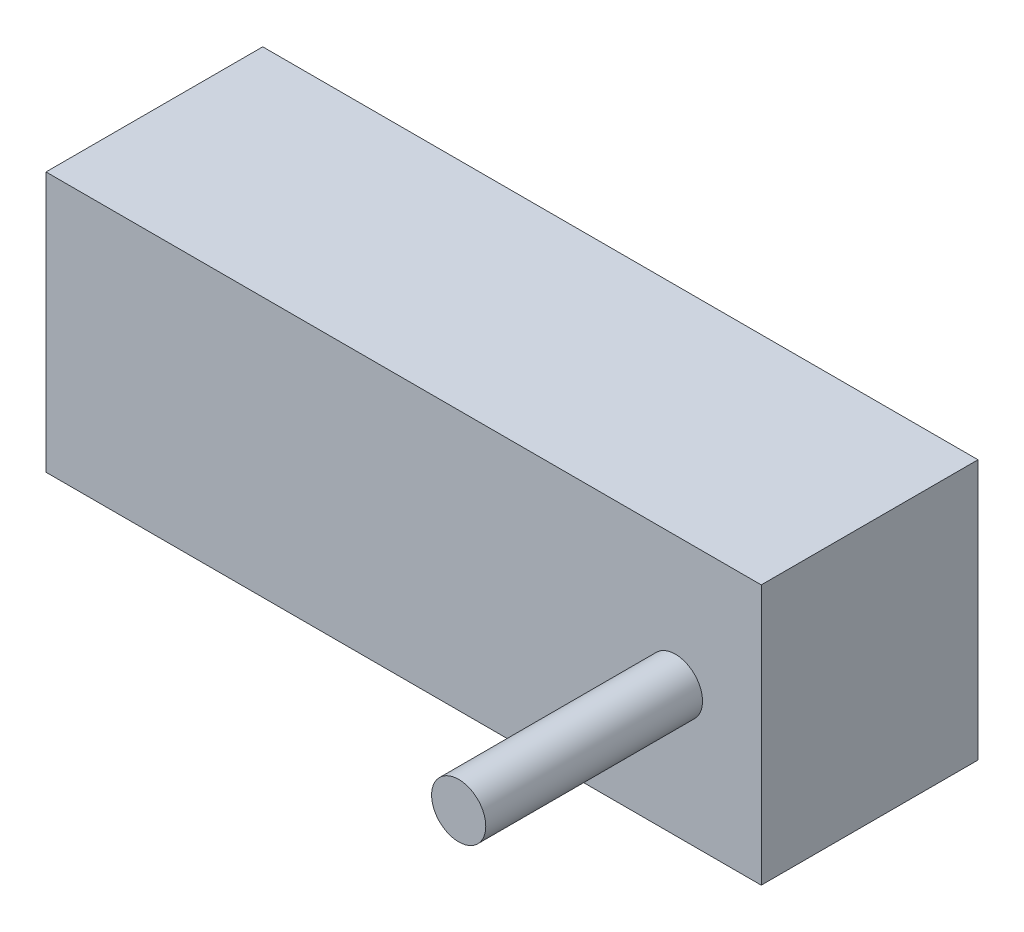
ISO-10303-21;
HEADER;
FILE_DESCRIPTION(('STEP AP214'),'2;1');
FILE_NAME('part.step','',(''),(''),'','','');
FILE_SCHEMA(('AUTOMOTIVE_DESIGN { 1 0 10303 214 1 1 1 1 }'));
ENDSEC;
DATA;
#1=APPLICATION_CONTEXT('core data for automotive mechanical design processes');
#2=APPLICATION_PROTOCOL_DEFINITION('international standard','automotive_design',2000,#1);
#3=PRODUCT_CONTEXT('',#1,'mechanical');
#4=PRODUCT('Part','Part','',(#3));
#5=PRODUCT_RELATED_PRODUCT_CATEGORY('part','',(#4));
#6=PRODUCT_DEFINITION_FORMATION('','',#4);
#7=PRODUCT_DEFINITION_CONTEXT('part definition',#1,'design');
#8=PRODUCT_DEFINITION('design','',#6,#7);
#9=PRODUCT_DEFINITION_SHAPE('','',#8);
#10=(LENGTH_UNIT() NAMED_UNIT(*) SI_UNIT(.MILLI.,.METRE.));
#11=(NAMED_UNIT(*) PLANE_ANGLE_UNIT() SI_UNIT($,.RADIAN.));
#12=(NAMED_UNIT(*) SI_UNIT($,.STERADIAN.) SOLID_ANGLE_UNIT());
#13=UNCERTAINTY_MEASURE_WITH_UNIT(LENGTH_MEASURE(1.E-05),#10,'distance_accuracy_value','');
#14=(GEOMETRIC_REPRESENTATION_CONTEXT(3) GLOBAL_UNCERTAINTY_ASSIGNED_CONTEXT((#13)) GLOBAL_UNIT_ASSIGNED_CONTEXT((#10,
#11,#12)) REPRESENTATION_CONTEXT('',''));
#15=CARTESIAN_POINT('',(0.,0.,0.));
#16=DIRECTION('',(0.,0.,1.));
#17=DIRECTION('',(1.,0.,0.));
#18=AXIS2_PLACEMENT_3D('',#15,#16,#17);
#19=CARTESIAN_POINT('',(29.04,6.,20.));
#20=DIRECTION('',(0.,0.,-1.));
#21=DIRECTION('',(-1.,0.,0.));
#22=AXIS2_PLACEMENT_3D('',#19,#20,#21);
#23=CYLINDRICAL_SURFACE('',#22,1.25);
#24=CARTESIAN_POINT('',(29.04,6.,20.));
#25=DIRECTION('',(0.,0.,1.));
#26=DIRECTION('',(1.,0.,0.));
#27=AXIS2_PLACEMENT_3D('',#24,#25,#26);
#28=CIRCLE('',#27,1.25);
#29=CARTESIAN_POINT('',(30.29,6.,20.));
#30=VERTEX_POINT('',#29);
#31=EDGE_CURVE('E48',#30,#30,#28,.T.);
#32=ORIENTED_EDGE('',*,*,#31,.F.);
#33=EDGE_LOOP('',(#32));
#34=FACE_BOUND('',#33,.T.);
#35=CARTESIAN_POINT('',(29.04,6.,10.));
#36=DIRECTION('',(0.,0.,-1.));
#37=DIRECTION('',(-1.,0.,0.));
#38=AXIS2_PLACEMENT_3D('',#35,#36,#37);
#39=CIRCLE('',#38,1.25);
#40=CARTESIAN_POINT('',(27.79,6.,10.));
#41=VERTEX_POINT('',#40);
#42=EDGE_CURVE('E11',#41,#41,#39,.T.);
#43=ORIENTED_EDGE('',*,*,#42,.F.);
#44=EDGE_LOOP('',(#43));
#45=FACE_BOUND('',#44,.T.);
#46=ADVANCED_FACE('F39',(#34,#45),#23,.T.);
#47=CARTESIAN_POINT('',(29.04,6.,20.));
#48=DIRECTION('',(0.,0.,1.));
#49=DIRECTION('',(1.,0.,0.));
#50=AXIS2_PLACEMENT_3D('',#47,#48,#49);
#51=PLANE('',#50);
#52=ORIENTED_EDGE('',*,*,#31,.T.);
#53=EDGE_LOOP('',(#52));
#54=FACE_BOUND('',#53,.T.);
#55=ADVANCED_FACE('F131',(#54),#51,.T.);
#56=CARTESIAN_POINT('',(0.,0.,10.));
#57=DIRECTION('',(0.,0.,-1.));
#58=DIRECTION('',(-1.,0.,0.));
#59=AXIS2_PLACEMENT_3D('',#56,#57,#58);
#60=PLANE('',#59);
#61=DIRECTION('',(0.,-1.,0.));
#62=VECTOR('',#61,1.);
#63=CARTESIAN_POINT('',(0.,0.,10.));
#64=LINE('',#63,#62);
#65=CARTESIAN_POINT('',(0.,12.,10.));
#66=VERTEX_POINT('',#65);
#67=CARTESIAN_POINT('',(0.,0.,10.));
#68=VERTEX_POINT('',#67);
#69=EDGE_CURVE('E93',#66,#68,#64,.T.);
#70=ORIENTED_EDGE('',*,*,#69,.T.);
#71=DIRECTION('',(1.,0.,0.));
#72=VECTOR('',#71,1.);
#73=CARTESIAN_POINT('',(0.,0.,10.));
#74=LINE('',#73,#72);
#75=CARTESIAN_POINT('',(33.,0.,10.));
#76=VERTEX_POINT('',#75);
#77=EDGE_CURVE('E87',#68,#76,#74,.T.);
#78=ORIENTED_EDGE('',*,*,#77,.T.);
#79=DIRECTION('',(0.,1.,0.));
#80=VECTOR('',#79,1.);
#81=CARTESIAN_POINT('',(33.,0.,10.));
#82=LINE('',#81,#80);
#83=CARTESIAN_POINT('',(33.,12.,10.));
#84=VERTEX_POINT('',#83);
#85=EDGE_CURVE('E91',#76,#84,#82,.T.);
#86=ORIENTED_EDGE('',*,*,#85,.T.);
#87=DIRECTION('',(-1.,0.,0.));
#88=VECTOR('',#87,1.);
#89=CARTESIAN_POINT('',(0.,12.,10.));
#90=LINE('',#89,#88);
#91=EDGE_CURVE('E56',#84,#66,#90,.T.);
#92=ORIENTED_EDGE('',*,*,#91,.T.);
#93=EDGE_LOOP('',(#70,#78,#86,#92));
#94=FACE_BOUND('',#93,.T.);
#95=ORIENTED_EDGE('',*,*,#42,.T.);
#96=EDGE_LOOP('',(#95));
#97=FACE_BOUND('',#96,.T.);
#98=ADVANCED_FACE('F88',(#94,#97),#60,.F.);
#99=CARTESIAN_POINT('',(0.,0.,10.));
#100=DIRECTION('',(1.,0.,0.));
#101=DIRECTION('',(0.,0.,-1.));
#102=AXIS2_PLACEMENT_3D('',#99,#100,#101);
#103=PLANE('',#102);
#104=DIRECTION('',(0.,-1.,0.));
#105=VECTOR('',#104,1.);
#106=CARTESIAN_POINT('',(0.,0.,0.));
#107=LINE('',#106,#105);
#108=CARTESIAN_POINT('',(0.,12.,0.));
#109=VERTEX_POINT('',#108);
#110=CARTESIAN_POINT('',(0.,0.,0.));
#111=VERTEX_POINT('',#110);
#112=EDGE_CURVE('E112',#109,#111,#107,.T.);
#113=ORIENTED_EDGE('',*,*,#112,.T.);
#114=DIRECTION('',(0.,0.,-1.));
#115=VECTOR('',#114,1.);
#116=CARTESIAN_POINT('',(0.,0.,10.));
#117=LINE('',#116,#115);
#118=EDGE_CURVE('E101',#68,#111,#117,.T.);
#119=ORIENTED_EDGE('',*,*,#118,.F.);
#120=ORIENTED_EDGE('',*,*,#69,.F.);
#121=DIRECTION('',(0.,0.,-1.));
#122=VECTOR('',#121,1.);
#123=CARTESIAN_POINT('',(0.,12.,10.));
#124=LINE('',#123,#122);
#125=EDGE_CURVE('E108',#66,#109,#124,.T.);
#126=ORIENTED_EDGE('',*,*,#125,.T.);
#127=EDGE_LOOP('',(#113,#119,#120,#126));
#128=FACE_BOUND('',#127,.T.);
#129=ADVANCED_FACE('F137',(#128),#103,.F.);
#130=CARTESIAN_POINT('',(0.,0.,10.));
#131=DIRECTION('',(0.,1.,0.));
#132=DIRECTION('',(0.,0.,1.));
#133=AXIS2_PLACEMENT_3D('',#130,#131,#132);
#134=PLANE('',#133);
#135=DIRECTION('',(1.,0.,0.));
#136=VECTOR('',#135,1.);
#137=CARTESIAN_POINT('',(0.,0.,0.));
#138=LINE('',#137,#136);
#139=CARTESIAN_POINT('',(33.,0.,0.));
#140=VERTEX_POINT('',#139);
#141=EDGE_CURVE('E99',#111,#140,#138,.T.);
#142=ORIENTED_EDGE('',*,*,#141,.T.);
#143=DIRECTION('',(0.,0.,-1.));
#144=VECTOR('',#143,1.);
#145=CARTESIAN_POINT('',(33.,0.,10.));
#146=LINE('',#145,#144);
#147=EDGE_CURVE('E97',#76,#140,#146,.T.);
#148=ORIENTED_EDGE('',*,*,#147,.F.);
#149=ORIENTED_EDGE('',*,*,#77,.F.);
#150=ORIENTED_EDGE('',*,*,#118,.T.);
#151=EDGE_LOOP('',(#142,#148,#149,#150));
#152=FACE_BOUND('',#151,.T.);
#153=ADVANCED_FACE('F98',(#152),#134,.F.);
#154=CARTESIAN_POINT('',(33.,0.,10.));
#155=DIRECTION('',(-1.,0.,0.));
#156=DIRECTION('',(0.,0.,1.));
#157=AXIS2_PLACEMENT_3D('',#154,#155,#156);
#158=PLANE('',#157);
#159=DIRECTION('',(0.,1.,0.));
#160=VECTOR('',#159,1.);
#161=CARTESIAN_POINT('',(33.,0.,0.));
#162=LINE('',#161,#160);
#163=CARTESIAN_POINT('',(33.,12.,0.));
#164=VERTEX_POINT('',#163);
#165=EDGE_CURVE('E73',#140,#164,#162,.T.);
#166=ORIENTED_EDGE('',*,*,#165,.T.);
#167=DIRECTION('',(0.,0.,-1.));
#168=VECTOR('',#167,1.);
#169=CARTESIAN_POINT('',(33.,12.,10.));
#170=LINE('',#169,#168);
#171=EDGE_CURVE('E102',#84,#164,#170,.T.);
#172=ORIENTED_EDGE('',*,*,#171,.F.);
#173=ORIENTED_EDGE('',*,*,#85,.F.);
#174=ORIENTED_EDGE('',*,*,#147,.T.);
#175=EDGE_LOOP('',(#166,#172,#173,#174));
#176=FACE_BOUND('',#175,.T.);
#177=ADVANCED_FACE('F104',(#176),#158,.F.);
#178=CARTESIAN_POINT('',(0.,12.,10.));
#179=DIRECTION('',(0.,-1.,0.));
#180=DIRECTION('',(0.,0.,-1.));
#181=AXIS2_PLACEMENT_3D('',#178,#179,#180);
#182=PLANE('',#181);
#183=DIRECTION('',(-1.,0.,0.));
#184=VECTOR('',#183,1.);
#185=CARTESIAN_POINT('',(0.,12.,0.));
#186=LINE('',#185,#184);
#187=EDGE_CURVE('E79',#164,#109,#186,.T.);
#188=ORIENTED_EDGE('',*,*,#187,.T.);
#189=ORIENTED_EDGE('',*,*,#125,.F.);
#190=ORIENTED_EDGE('',*,*,#91,.F.);
#191=ORIENTED_EDGE('',*,*,#171,.T.);
#192=EDGE_LOOP('',(#188,#189,#190,#191));
#193=FACE_BOUND('',#192,.T.);
#194=ADVANCED_FACE('F147',(#193),#182,.F.);
#195=CARTESIAN_POINT('',(29.04,6.,0.));
#196=DIRECTION('',(0.,0.,1.));
#197=DIRECTION('',(1.,0.,0.));
#198=AXIS2_PLACEMENT_3D('',#195,#196,#197);
#199=PLANE('',#198);
#200=ORIENTED_EDGE('',*,*,#112,.F.);
#201=ORIENTED_EDGE('',*,*,#187,.F.);
#202=ORIENTED_EDGE('',*,*,#165,.F.);
#203=ORIENTED_EDGE('',*,*,#141,.F.);
#204=EDGE_LOOP('',(#200,#201,#202,#203));
#205=FACE_BOUND('',#204,.T.);
#206=ADVANCED_FACE('F150',(#205),#199,.F.);
#207=CLOSED_SHELL('',(#46,#55,#98,#129,#153,#177,#194,#206));
#208=MANIFOLD_SOLID_BREP('B2',#207);
#209=ADVANCED_BREP_SHAPE_REPRESENTATION('',(#18,#208),#14);
#210=SHAPE_DEFINITION_REPRESENTATION(#9,#209);
ENDSEC;
END-ISO-10303-21;
